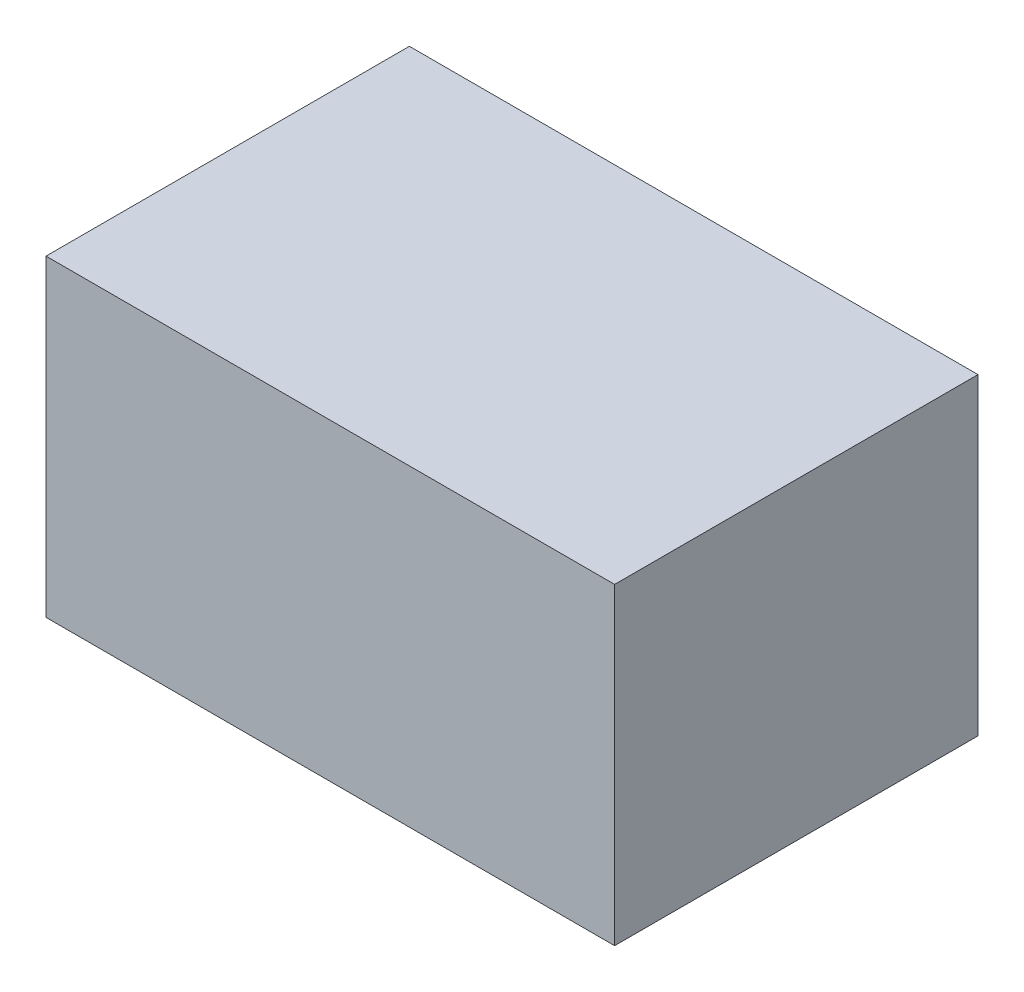
ISO-10303-21;
HEADER;
FILE_DESCRIPTION(('STEP AP214'),'2;1');
FILE_NAME('part.step','',(''),(''),'','','');
FILE_SCHEMA(('AUTOMOTIVE_DESIGN { 1 0 10303 214 1 1 1 1 }'));
ENDSEC;
DATA;
#1=APPLICATION_CONTEXT('core data for automotive mechanical design processes');
#2=APPLICATION_PROTOCOL_DEFINITION('international standard','automotive_design',2000,#1);
#3=PRODUCT_CONTEXT('',#1,'mechanical');
#4=PRODUCT('Part','Part','',(#3));
#5=PRODUCT_RELATED_PRODUCT_CATEGORY('part','',(#4));
#6=PRODUCT_DEFINITION_FORMATION('','',#4);
#7=PRODUCT_DEFINITION_CONTEXT('part definition',#1,'design');
#8=PRODUCT_DEFINITION('design','',#6,#7);
#9=PRODUCT_DEFINITION_SHAPE('','',#8);
#10=(LENGTH_UNIT() NAMED_UNIT(*) SI_UNIT(.MILLI.,.METRE.));
#11=(NAMED_UNIT(*) PLANE_ANGLE_UNIT() SI_UNIT($,.RADIAN.));
#12=(NAMED_UNIT(*) SI_UNIT($,.STERADIAN.) SOLID_ANGLE_UNIT());
#13=UNCERTAINTY_MEASURE_WITH_UNIT(LENGTH_MEASURE(1.E-05),#10,'distance_accuracy_value','');
#14=(GEOMETRIC_REPRESENTATION_CONTEXT(3) GLOBAL_UNCERTAINTY_ASSIGNED_CONTEXT((#13)) GLOBAL_UNIT_ASSIGNED_CONTEXT((#10,
#11,#12)) REPRESENTATION_CONTEXT('',''));
#15=CARTESIAN_POINT('',(0.,0.,0.));
#16=DIRECTION('',(0.,0.,1.));
#17=DIRECTION('',(1.,0.,0.));
#18=AXIS2_PLACEMENT_3D('',#15,#16,#17);
#19=CARTESIAN_POINT('',(0.,46.5,0.));
#20=DIRECTION('',(1.,0.,0.));
#21=DIRECTION('',(0.,0.,-1.));
#22=AXIS2_PLACEMENT_3D('',#19,#20,#21);
#23=PLANE('',#22);
#24=DIRECTION('',(0.,0.,1.));
#25=VECTOR('',#24,1.);
#26=CARTESIAN_POINT('',(0.,0.,0.));
#27=LINE('',#26,#25);
#28=CARTESIAN_POINT('',(0.,0.,-54.));
#29=VERTEX_POINT('',#28);
#30=CARTESIAN_POINT('',(0.,0.,0.));
#31=VERTEX_POINT('',#30);
#32=EDGE_CURVE('E96',#29,#31,#27,.T.);
#33=ORIENTED_EDGE('',*,*,#32,.T.);
#34=DIRECTION('',(0.,-1.,0.));
#35=VECTOR('',#34,1.);
#36=CARTESIAN_POINT('',(0.,46.5,0.));
#37=LINE('',#36,#35);
#38=CARTESIAN_POINT('',(0.,46.5,0.));
#39=VERTEX_POINT('',#38);
#40=EDGE_CURVE('E11',#39,#31,#37,.T.);
#41=ORIENTED_EDGE('',*,*,#40,.F.);
#42=DIRECTION('',(0.,0.,1.));
#43=VECTOR('',#42,1.);
#44=CARTESIAN_POINT('',(0.,46.5,0.));
#45=LINE('',#44,#43);
#46=CARTESIAN_POINT('',(0.,46.5,-54.));
#47=VERTEX_POINT('',#46);
#48=EDGE_CURVE('E84',#47,#39,#45,.T.);
#49=ORIENTED_EDGE('',*,*,#48,.F.);
#50=DIRECTION('',(0.,-1.,0.));
#51=VECTOR('',#50,1.);
#52=CARTESIAN_POINT('',(0.,46.5,-54.));
#53=LINE('',#52,#51);
#54=EDGE_CURVE('E92',#47,#29,#53,.T.);
#55=ORIENTED_EDGE('',*,*,#54,.T.);
#56=EDGE_LOOP('',(#33,#41,#49,#55));
#57=FACE_BOUND('',#56,.T.);
#58=ADVANCED_FACE('F33',(#57),#23,.F.);
#59=CARTESIAN_POINT('',(0.,46.5,0.));
#60=DIRECTION('',(0.,0.,-1.));
#61=DIRECTION('',(-1.,0.,0.));
#62=AXIS2_PLACEMENT_3D('',#59,#60,#61);
#63=PLANE('',#62);
#64=DIRECTION('',(1.,0.,0.));
#65=VECTOR('',#64,1.);
#66=CARTESIAN_POINT('',(0.,0.,0.));
#67=LINE('',#66,#65);
#68=CARTESIAN_POINT('',(84.5,0.,0.));
#69=VERTEX_POINT('',#68);
#70=EDGE_CURVE('E88',#31,#69,#67,.T.);
#71=ORIENTED_EDGE('',*,*,#70,.T.);
#72=DIRECTION('',(0.,-1.,0.));
#73=VECTOR('',#72,1.);
#74=CARTESIAN_POINT('',(84.5,46.5,0.));
#75=LINE('',#74,#73);
#76=CARTESIAN_POINT('',(84.5,46.5,0.));
#77=VERTEX_POINT('',#76);
#78=EDGE_CURVE('E41',#77,#69,#75,.T.);
#79=ORIENTED_EDGE('',*,*,#78,.F.);
#80=DIRECTION('',(1.,0.,0.));
#81=VECTOR('',#80,1.);
#82=CARTESIAN_POINT('',(0.,46.5,0.));
#83=LINE('',#82,#81);
#84=EDGE_CURVE('E79',#39,#77,#83,.T.);
#85=ORIENTED_EDGE('',*,*,#84,.F.);
#86=ORIENTED_EDGE('',*,*,#40,.T.);
#87=EDGE_LOOP('',(#71,#79,#85,#86));
#88=FACE_BOUND('',#87,.T.);
#89=ADVANCED_FACE('F87',(#88),#63,.F.);
#90=CARTESIAN_POINT('',(84.5,46.5,0.));
#91=DIRECTION('',(-1.,0.,0.));
#92=DIRECTION('',(0.,0.,1.));
#93=AXIS2_PLACEMENT_3D('',#90,#91,#92);
#94=PLANE('',#93);
#95=DIRECTION('',(0.,0.,-1.));
#96=VECTOR('',#95,1.);
#97=CARTESIAN_POINT('',(84.5,0.,0.));
#98=LINE('',#97,#96);
#99=CARTESIAN_POINT('',(84.5,0.,-54.));
#100=VERTEX_POINT('',#99);
#101=EDGE_CURVE('E66',#69,#100,#98,.T.);
#102=ORIENTED_EDGE('',*,*,#101,.T.);
#103=DIRECTION('',(0.,-1.,0.));
#104=VECTOR('',#103,1.);
#105=CARTESIAN_POINT('',(84.5,46.5,-54.));
#106=LINE('',#105,#104);
#107=CARTESIAN_POINT('',(84.5,46.5,-54.));
#108=VERTEX_POINT('',#107);
#109=EDGE_CURVE('E89',#108,#100,#106,.T.);
#110=ORIENTED_EDGE('',*,*,#109,.F.);
#111=DIRECTION('',(0.,0.,-1.));
#112=VECTOR('',#111,1.);
#113=CARTESIAN_POINT('',(84.5,46.5,0.));
#114=LINE('',#113,#112);
#115=EDGE_CURVE('E82',#77,#108,#114,.T.);
#116=ORIENTED_EDGE('',*,*,#115,.F.);
#117=ORIENTED_EDGE('',*,*,#78,.T.);
#118=EDGE_LOOP('',(#102,#110,#116,#117));
#119=FACE_BOUND('',#118,.T.);
#120=ADVANCED_FACE('F90',(#119),#94,.F.);
#121=CARTESIAN_POINT('',(0.,46.5,-54.));
#122=DIRECTION('',(0.,0.,1.));
#123=DIRECTION('',(1.,0.,0.));
#124=AXIS2_PLACEMENT_3D('',#121,#122,#123);
#125=PLANE('',#124);
#126=DIRECTION('',(-1.,0.,0.));
#127=VECTOR('',#126,1.);
#128=CARTESIAN_POINT('',(0.,0.,-54.));
#129=LINE('',#128,#127);
#130=EDGE_CURVE('E72',#100,#29,#129,.T.);
#131=ORIENTED_EDGE('',*,*,#130,.T.);
#132=ORIENTED_EDGE('',*,*,#54,.F.);
#133=DIRECTION('',(-1.,0.,0.));
#134=VECTOR('',#133,1.);
#135=CARTESIAN_POINT('',(0.,46.5,-54.));
#136=LINE('',#135,#134);
#137=EDGE_CURVE('E49',#108,#47,#136,.T.);
#138=ORIENTED_EDGE('',*,*,#137,.F.);
#139=ORIENTED_EDGE('',*,*,#109,.T.);
#140=EDGE_LOOP('',(#131,#132,#138,#139));
#141=FACE_BOUND('',#140,.T.);
#142=ADVANCED_FACE('F103',(#141),#125,.F.);
#143=CARTESIAN_POINT('',(0.,46.5,0.));
#144=DIRECTION('',(0.,-1.,0.));
#145=DIRECTION('',(0.,0.,-1.));
#146=AXIS2_PLACEMENT_3D('',#143,#144,#145);
#147=PLANE('',#146);
#148=ORIENTED_EDGE('',*,*,#48,.T.);
#149=ORIENTED_EDGE('',*,*,#84,.T.);
#150=ORIENTED_EDGE('',*,*,#115,.T.);
#151=ORIENTED_EDGE('',*,*,#137,.T.);
#152=EDGE_LOOP('',(#148,#149,#150,#151));
#153=FACE_BOUND('',#152,.T.);
#154=ADVANCED_FACE('F80',(#153),#147,.F.);
#155=CARTESIAN_POINT('',(0.,0.,0.));
#156=DIRECTION('',(0.,-1.,0.));
#157=DIRECTION('',(0.,0.,-1.));
#158=AXIS2_PLACEMENT_3D('',#155,#156,#157);
#159=PLANE('',#158);
#160=ORIENTED_EDGE('',*,*,#32,.F.);
#161=ORIENTED_EDGE('',*,*,#130,.F.);
#162=ORIENTED_EDGE('',*,*,#101,.F.);
#163=ORIENTED_EDGE('',*,*,#70,.F.);
#164=EDGE_LOOP('',(#160,#161,#162,#163));
#165=FACE_BOUND('',#164,.T.);
#166=ADVANCED_FACE('F106',(#165),#159,.T.);
#167=CLOSED_SHELL('',(#58,#89,#120,#142,#154,#166));
#168=MANIFOLD_SOLID_BREP('B2',#167);
#169=ADVANCED_BREP_SHAPE_REPRESENTATION('',(#18,#168),#14);
#170=SHAPE_DEFINITION_REPRESENTATION(#9,#169);
ENDSEC;
END-ISO-10303-21;
